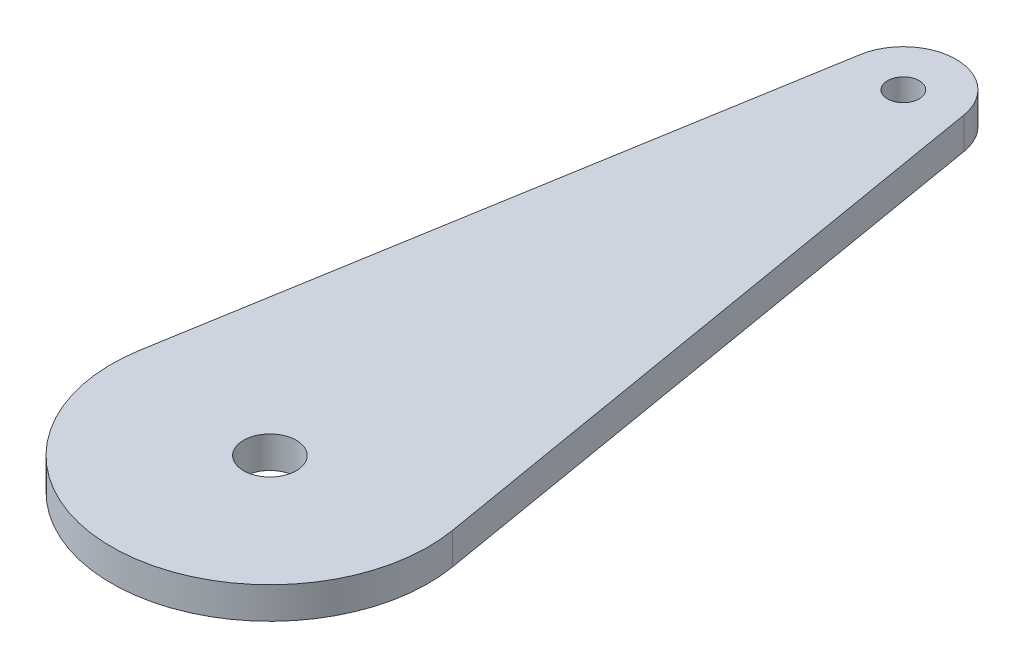
ISO-10303-21;
HEADER;
FILE_DESCRIPTION(('STEP AP214'),'2;1');
FILE_NAME('part.step','',(''),(''),'','','');
FILE_SCHEMA(('AUTOMOTIVE_DESIGN { 1 0 10303 214 1 1 1 1 }'));
ENDSEC;
DATA;
#1=APPLICATION_CONTEXT('core data for automotive mechanical design processes');
#2=APPLICATION_PROTOCOL_DEFINITION('international standard','automotive_design',2000,#1);
#3=PRODUCT_CONTEXT('',#1,'mechanical');
#4=PRODUCT('Part','Part','',(#3));
#5=PRODUCT_RELATED_PRODUCT_CATEGORY('part','',(#4));
#6=PRODUCT_DEFINITION_FORMATION('','',#4);
#7=PRODUCT_DEFINITION_CONTEXT('part definition',#1,'design');
#8=PRODUCT_DEFINITION('design','',#6,#7);
#9=PRODUCT_DEFINITION_SHAPE('','',#8);
#10=(LENGTH_UNIT() NAMED_UNIT(*) SI_UNIT(.MILLI.,.METRE.));
#11=(NAMED_UNIT(*) PLANE_ANGLE_UNIT() SI_UNIT($,.RADIAN.));
#12=(NAMED_UNIT(*) SI_UNIT($,.STERADIAN.) SOLID_ANGLE_UNIT());
#13=UNCERTAINTY_MEASURE_WITH_UNIT(LENGTH_MEASURE(1.E-05),#10,'distance_accuracy_value','');
#14=(GEOMETRIC_REPRESENTATION_CONTEXT(3) GLOBAL_UNCERTAINTY_ASSIGNED_CONTEXT((#13)) GLOBAL_UNIT_ASSIGNED_CONTEXT((#10,
#11,#12)) REPRESENTATION_CONTEXT('',''));
#15=CARTESIAN_POINT('',(0.,0.,0.));
#16=DIRECTION('',(0.,0.,1.));
#17=DIRECTION('',(1.,0.,0.));
#18=AXIS2_PLACEMENT_3D('',#15,#16,#17);
#19=CARTESIAN_POINT('',(0.,3.,-60.));
#20=DIRECTION('',(0.,1.,0.));
#21=DIRECTION('',(0.,0.,1.));
#22=AXIS2_PLACEMENT_3D('',#19,#20,#21);
#23=PLANE('',#22);
#24=CARTESIAN_POINT('',(0.,3.,0.));
#25=DIRECTION('',(0.,1.,0.));
#26=DIRECTION('',(0.,0.,1.));
#27=AXIS2_PLACEMENT_3D('',#24,#25,#26);
#28=CIRCLE('',#27,2.5);
#29=CARTESIAN_POINT('',(0.,3.,2.5));
#30=VERTEX_POINT('',#29);
#31=EDGE_CURVE('E121',#30,#30,#28,.T.);
#32=ORIENTED_EDGE('',*,*,#31,.F.);
#33=EDGE_LOOP('',(#32));
#34=FACE_BOUND('',#33,.T.);
#35=CARTESIAN_POINT('',(0.,3.,-60.));
#36=DIRECTION('',(0.,1.,0.));
#37=DIRECTION('',(0.,0.,1.));
#38=AXIS2_PLACEMENT_3D('',#35,#36,#37);
#39=CIRCLE('',#38,5.);
#40=CARTESIAN_POINT('',(4.93006648591635,3.,-60.8333333333333));
#41=VERTEX_POINT('',#40);
#42=CARTESIAN_POINT('',(-4.93006648591634,3.,-60.8333333333333));
#43=VERTEX_POINT('',#42);
#44=EDGE_CURVE('E88',#41,#43,#39,.T.);
#45=ORIENTED_EDGE('',*,*,#44,.T.);
#46=DIRECTION('',(-0.166666666666667,0.,0.986013297183269));
#47=VECTOR('',#46,1.);
#48=CARTESIAN_POINT('',(-4.93006648591634,3.,-60.8333333333333));
#49=LINE('',#48,#47);
#50=CARTESIAN_POINT('',(-14.790199457749,3.,-2.5));
#51=VERTEX_POINT('',#50);
#52=EDGE_CURVE('E83',#43,#51,#49,.T.);
#53=ORIENTED_EDGE('',*,*,#52,.T.);
#54=CARTESIAN_POINT('',(0.,3.,0.));
#55=DIRECTION('',(0.,1.,0.));
#56=DIRECTION('',(0.,0.,1.));
#57=AXIS2_PLACEMENT_3D('',#54,#55,#56);
#58=CIRCLE('',#57,15.);
#59=CARTESIAN_POINT('',(14.790199457749,3.,-2.49999999999999));
#60=VERTEX_POINT('',#59);
#61=EDGE_CURVE('E86',#51,#60,#58,.T.);
#62=ORIENTED_EDGE('',*,*,#61,.T.);
#63=DIRECTION('',(-0.166666666666667,0.,-0.986013297183269));
#64=VECTOR('',#63,1.);
#65=CARTESIAN_POINT('',(14.790199457749,3.,-2.5));
#66=LINE('',#65,#64);
#67=EDGE_CURVE('E53',#60,#41,#66,.T.);
#68=ORIENTED_EDGE('',*,*,#67,.T.);
#69=EDGE_LOOP('',(#45,#53,#62,#68));
#70=FACE_BOUND('',#69,.T.);
#71=CARTESIAN_POINT('',(0.,3.,-60.));
#72=DIRECTION('',(0.,1.,0.));
#73=DIRECTION('',(0.,0.,1.));
#74=AXIS2_PLACEMENT_3D('',#71,#72,#73);
#75=CIRCLE('',#74,1.5);
#76=CARTESIAN_POINT('',(0.,3.,-58.5));
#77=VERTEX_POINT('',#76);
#78=EDGE_CURVE('E103',#77,#77,#75,.T.);
#79=ORIENTED_EDGE('',*,*,#78,.F.);
#80=EDGE_LOOP('',(#79));
#81=FACE_BOUND('',#80,.T.);
#82=ADVANCED_FACE('F36',(#34,#70,#81),#23,.T.);
#83=CARTESIAN_POINT('',(0.,0.,-60.));
#84=DIRECTION('',(0.,1.,0.));
#85=DIRECTION('',(0.,0.,1.));
#86=AXIS2_PLACEMENT_3D('',#83,#84,#85);
#87=PLANE('',#86);
#88=CARTESIAN_POINT('',(0.,0.,0.));
#89=DIRECTION('',(0.,1.,0.));
#90=DIRECTION('',(0.,0.,1.));
#91=AXIS2_PLACEMENT_3D('',#88,#89,#90);
#92=CIRCLE('',#91,2.5);
#93=CARTESIAN_POINT('',(0.,0.,2.5));
#94=VERTEX_POINT('',#93);
#95=EDGE_CURVE('E118',#94,#94,#92,.T.);
#96=ORIENTED_EDGE('',*,*,#95,.T.);
#97=EDGE_LOOP('',(#96));
#98=FACE_BOUND('',#97,.T.);
#99=CARTESIAN_POINT('',(0.,0.,-60.));
#100=DIRECTION('',(0.,1.,0.));
#101=DIRECTION('',(0.,0.,1.));
#102=AXIS2_PLACEMENT_3D('',#99,#100,#101);
#103=CIRCLE('',#102,5.);
#104=CARTESIAN_POINT('',(4.93006648591635,0.,-60.8333333333333));
#105=VERTEX_POINT('',#104);
#106=CARTESIAN_POINT('',(-4.93006648591634,0.,-60.8333333333333));
#107=VERTEX_POINT('',#106);
#108=EDGE_CURVE('E100',#105,#107,#103,.T.);
#109=ORIENTED_EDGE('',*,*,#108,.F.);
#110=DIRECTION('',(-0.166666666666667,0.,-0.986013297183269));
#111=VECTOR('',#110,1.);
#112=CARTESIAN_POINT('',(14.790199457749,0.,-2.5));
#113=LINE('',#112,#111);
#114=CARTESIAN_POINT('',(14.790199457749,0.,-2.49999999999999));
#115=VERTEX_POINT('',#114);
#116=EDGE_CURVE('E76',#115,#105,#113,.T.);
#117=ORIENTED_EDGE('',*,*,#116,.F.);
#118=CARTESIAN_POINT('',(0.,0.,0.));
#119=DIRECTION('',(0.,1.,0.));
#120=DIRECTION('',(0.,0.,1.));
#121=AXIS2_PLACEMENT_3D('',#118,#119,#120);
#122=CIRCLE('',#121,15.);
#123=CARTESIAN_POINT('',(-14.790199457749,0.,-2.5));
#124=VERTEX_POINT('',#123);
#125=EDGE_CURVE('E70',#124,#115,#122,.T.);
#126=ORIENTED_EDGE('',*,*,#125,.F.);
#127=DIRECTION('',(-0.166666666666667,0.,0.986013297183269));
#128=VECTOR('',#127,1.);
#129=CARTESIAN_POINT('',(-4.93006648591634,0.,-60.8333333333333));
#130=LINE('',#129,#128);
#131=EDGE_CURVE('E92',#107,#124,#130,.T.);
#132=ORIENTED_EDGE('',*,*,#131,.F.);
#133=EDGE_LOOP('',(#109,#117,#126,#132));
#134=FACE_BOUND('',#133,.T.);
#135=CARTESIAN_POINT('',(0.,0.,-60.));
#136=DIRECTION('',(0.,1.,0.));
#137=DIRECTION('',(0.,0.,1.));
#138=AXIS2_PLACEMENT_3D('',#135,#136,#137);
#139=CIRCLE('',#138,1.5);
#140=CARTESIAN_POINT('',(0.,0.,-58.5));
#141=VERTEX_POINT('',#140);
#142=EDGE_CURVE('E115',#141,#141,#139,.T.);
#143=ORIENTED_EDGE('',*,*,#142,.T.);
#144=EDGE_LOOP('',(#143));
#145=FACE_BOUND('',#144,.T.);
#146=ADVANCED_FACE('F111',(#98,#134,#145),#87,.F.);
#147=CARTESIAN_POINT('',(0.,3.,-60.));
#148=DIRECTION('',(0.,-1.,0.));
#149=DIRECTION('',(0.,0.,-1.));
#150=AXIS2_PLACEMENT_3D('',#147,#148,#149);
#151=CYLINDRICAL_SURFACE('',#150,5.);
#152=ORIENTED_EDGE('',*,*,#108,.T.);
#153=DIRECTION('',(0.,-1.,0.));
#154=VECTOR('',#153,1.);
#155=CARTESIAN_POINT('',(-4.93006648591634,3.,-60.8333333333333));
#156=LINE('',#155,#154);
#157=EDGE_CURVE('E11',#43,#107,#156,.T.);
#158=ORIENTED_EDGE('',*,*,#157,.F.);
#159=ORIENTED_EDGE('',*,*,#44,.F.);
#160=DIRECTION('',(0.,-1.,0.));
#161=VECTOR('',#160,1.);
#162=CARTESIAN_POINT('',(4.93006648591635,3.,-60.8333333333333));
#163=LINE('',#162,#161);
#164=EDGE_CURVE('E96',#41,#105,#163,.T.);
#165=ORIENTED_EDGE('',*,*,#164,.T.);
#166=EDGE_LOOP('',(#152,#158,#159,#165));
#167=FACE_BOUND('',#166,.T.);
#168=ADVANCED_FACE('F38',(#167),#151,.T.);
#169=CARTESIAN_POINT('',(-4.93006648591634,3.,-60.8333333333333));
#170=DIRECTION('',(0.986013297183269,0.,0.166666666666667));
#171=DIRECTION('',(0.166666666666667,0.,-0.986013297183269));
#172=AXIS2_PLACEMENT_3D('',#169,#170,#171);
#173=PLANE('',#172);
#174=ORIENTED_EDGE('',*,*,#131,.T.);
#175=DIRECTION('',(0.,-1.,0.));
#176=VECTOR('',#175,1.);
#177=CARTESIAN_POINT('',(-14.790199457749,3.,-2.5));
#178=LINE('',#177,#176);
#179=EDGE_CURVE('E45',#51,#124,#178,.T.);
#180=ORIENTED_EDGE('',*,*,#179,.F.);
#181=ORIENTED_EDGE('',*,*,#52,.F.);
#182=ORIENTED_EDGE('',*,*,#157,.T.);
#183=EDGE_LOOP('',(#174,#180,#181,#182));
#184=FACE_BOUND('',#183,.T.);
#185=ADVANCED_FACE('F91',(#184),#173,.F.);
#186=CARTESIAN_POINT('',(0.,3.,0.));
#187=DIRECTION('',(0.,-1.,0.));
#188=DIRECTION('',(0.,0.,-1.));
#189=AXIS2_PLACEMENT_3D('',#186,#187,#188);
#190=CYLINDRICAL_SURFACE('',#189,15.);
#191=ORIENTED_EDGE('',*,*,#125,.T.);
#192=DIRECTION('',(0.,-1.,0.));
#193=VECTOR('',#192,1.);
#194=CARTESIAN_POINT('',(14.790199457749,3.,-2.49999999999999));
#195=LINE('',#194,#193);
#196=EDGE_CURVE('E93',#60,#115,#195,.T.);
#197=ORIENTED_EDGE('',*,*,#196,.F.);
#198=ORIENTED_EDGE('',*,*,#61,.F.);
#199=ORIENTED_EDGE('',*,*,#179,.T.);
#200=EDGE_LOOP('',(#191,#197,#198,#199));
#201=FACE_BOUND('',#200,.T.);
#202=ADVANCED_FACE('F94',(#201),#190,.T.);
#203=CARTESIAN_POINT('',(14.790199457749,3.,-2.5));
#204=DIRECTION('',(-0.986013297183269,0.,0.166666666666667));
#205=DIRECTION('',(0.166666666666667,0.,0.986013297183269));
#206=AXIS2_PLACEMENT_3D('',#203,#204,#205);
#207=PLANE('',#206);
#208=ORIENTED_EDGE('',*,*,#116,.T.);
#209=ORIENTED_EDGE('',*,*,#164,.F.);
#210=ORIENTED_EDGE('',*,*,#67,.F.);
#211=ORIENTED_EDGE('',*,*,#196,.T.);
#212=EDGE_LOOP('',(#208,#209,#210,#211));
#213=FACE_BOUND('',#212,.T.);
#214=ADVANCED_FACE('F108',(#213),#207,.F.);
#215=CARTESIAN_POINT('',(0.,3.,-60.));
#216=DIRECTION('',(0.,-1.,0.));
#217=DIRECTION('',(0.,0.,-1.));
#218=AXIS2_PLACEMENT_3D('',#215,#216,#217);
#219=CYLINDRICAL_SURFACE('',#218,1.5);
#220=ORIENTED_EDGE('',*,*,#78,.T.);
#221=EDGE_LOOP('',(#220));
#222=FACE_BOUND('',#221,.T.);
#223=ORIENTED_EDGE('',*,*,#142,.F.);
#224=EDGE_LOOP('',(#223));
#225=FACE_BOUND('',#224,.T.);
#226=ADVANCED_FACE('F131',(#222,#225),#219,.F.);
#227=CARTESIAN_POINT('',(0.,0.,0.));
#228=DIRECTION('',(0.,1.,0.));
#229=DIRECTION('',(0.,0.,1.));
#230=AXIS2_PLACEMENT_3D('',#227,#228,#229);
#231=CYLINDRICAL_SURFACE('',#230,2.5);
#232=ORIENTED_EDGE('',*,*,#95,.F.);
#233=EDGE_LOOP('',(#232));
#234=FACE_BOUND('',#233,.T.);
#235=ORIENTED_EDGE('',*,*,#31,.T.);
#236=EDGE_LOOP('',(#235));
#237=FACE_BOUND('',#236,.T.);
#238=ADVANCED_FACE('F128',(#234,#237),#231,.F.);
#239=CLOSED_SHELL('',(#82,#146,#168,#185,#202,#214,#226,#238));
#240=MANIFOLD_SOLID_BREP('B2',#239);
#241=ADVANCED_BREP_SHAPE_REPRESENTATION('',(#18,#240),#14);
#242=SHAPE_DEFINITION_REPRESENTATION(#9,#241);
ENDSEC;
END-ISO-10303-21;
